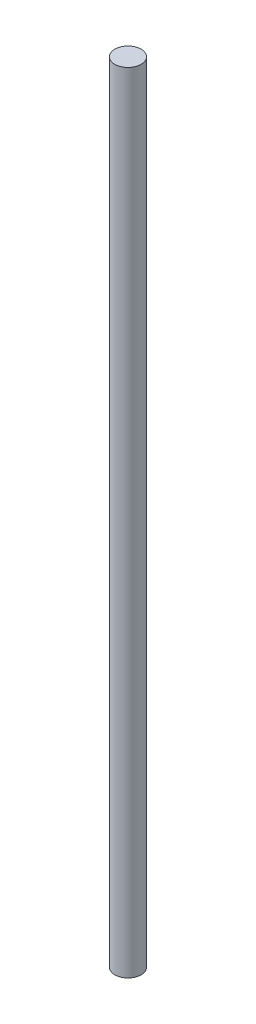
ISO-10303-21;
HEADER;
FILE_DESCRIPTION(('STEP AP214'),'2;1');
FILE_NAME('part.step','',(''),(''),'','','');
FILE_SCHEMA(('AUTOMOTIVE_DESIGN { 1 0 10303 214 1 1 1 1 }'));
ENDSEC;
DATA;
#1=APPLICATION_CONTEXT('core data for automotive mechanical design processes');
#2=APPLICATION_PROTOCOL_DEFINITION('international standard','automotive_design',2000,#1);
#3=PRODUCT_CONTEXT('',#1,'mechanical');
#4=PRODUCT('Part','Part','',(#3));
#5=PRODUCT_RELATED_PRODUCT_CATEGORY('part','',(#4));
#6=PRODUCT_DEFINITION_FORMATION('','',#4);
#7=PRODUCT_DEFINITION_CONTEXT('part definition',#1,'design');
#8=PRODUCT_DEFINITION('design','',#6,#7);
#9=PRODUCT_DEFINITION_SHAPE('','',#8);
#10=(LENGTH_UNIT() NAMED_UNIT(*) SI_UNIT(.MILLI.,.METRE.));
#11=(NAMED_UNIT(*) PLANE_ANGLE_UNIT() SI_UNIT($,.RADIAN.));
#12=(NAMED_UNIT(*) SI_UNIT($,.STERADIAN.) SOLID_ANGLE_UNIT());
#13=UNCERTAINTY_MEASURE_WITH_UNIT(LENGTH_MEASURE(1.E-05),#10,'distance_accuracy_value','');
#14=(GEOMETRIC_REPRESENTATION_CONTEXT(3) GLOBAL_UNCERTAINTY_ASSIGNED_CONTEXT((#13)) GLOBAL_UNIT_ASSIGNED_CONTEXT((#10,
#11,#12)) REPRESENTATION_CONTEXT('',''));
#15=CARTESIAN_POINT('',(0.,0.,0.));
#16=DIRECTION('',(0.,0.,1.));
#17=DIRECTION('',(1.,0.,0.));
#18=AXIS2_PLACEMENT_3D('',#15,#16,#17);
#19=CARTESIAN_POINT('',(0.,150.,0.));
#20=DIRECTION('',(0.,-1.,0.));
#21=DIRECTION('',(0.,0.,-1.));
#22=AXIS2_PLACEMENT_3D('',#19,#20,#21);
#23=CYLINDRICAL_SURFACE('',#22,2.5);
#24=CARTESIAN_POINT('',(0.,150.,0.));
#25=DIRECTION('',(0.,1.,0.));
#26=DIRECTION('',(0.,0.,1.));
#27=AXIS2_PLACEMENT_3D('',#24,#25,#26);
#28=CIRCLE('',#27,2.5);
#29=CARTESIAN_POINT('',(0.,150.,2.5));
#30=VERTEX_POINT('',#29);
#31=EDGE_CURVE('E10',#30,#30,#28,.T.);
#32=ORIENTED_EDGE('',*,*,#31,.F.);
#33=EDGE_LOOP('',(#32));
#34=FACE_BOUND('',#33,.T.);
#35=CARTESIAN_POINT('',(0.,0.,0.));
#36=DIRECTION('',(0.,1.,0.));
#37=DIRECTION('',(0.,0.,1.));
#38=AXIS2_PLACEMENT_3D('',#35,#36,#37);
#39=CIRCLE('',#38,2.5);
#40=CARTESIAN_POINT('',(0.,0.,2.5));
#41=VERTEX_POINT('',#40);
#42=EDGE_CURVE('E34',#41,#41,#39,.T.);
#43=ORIENTED_EDGE('',*,*,#42,.T.);
#44=EDGE_LOOP('',(#43));
#45=FACE_BOUND('',#44,.T.);
#46=ADVANCED_FACE('F31',(#34,#45),#23,.T.);
#47=CARTESIAN_POINT('',(0.,150.,0.));
#48=DIRECTION('',(0.,1.,0.));
#49=DIRECTION('',(0.,0.,1.));
#50=AXIS2_PLACEMENT_3D('',#47,#48,#49);
#51=PLANE('',#50);
#52=ORIENTED_EDGE('',*,*,#31,.T.);
#53=EDGE_LOOP('',(#52));
#54=FACE_BOUND('',#53,.T.);
#55=ADVANCED_FACE('F46',(#54),#51,.T.);
#56=CARTESIAN_POINT('',(0.,0.,0.));
#57=DIRECTION('',(0.,1.,0.));
#58=DIRECTION('',(0.,0.,1.));
#59=AXIS2_PLACEMENT_3D('',#56,#57,#58);
#60=PLANE('',#59);
#61=ORIENTED_EDGE('',*,*,#42,.F.);
#62=EDGE_LOOP('',(#61));
#63=FACE_BOUND('',#62,.T.);
#64=ADVANCED_FACE('F44',(#63),#60,.F.);
#65=CLOSED_SHELL('',(#46,#55,#64));
#66=MANIFOLD_SOLID_BREP('B2',#65);
#67=ADVANCED_BREP_SHAPE_REPRESENTATION('',(#18,#66),#14);
#68=SHAPE_DEFINITION_REPRESENTATION(#9,#67);
ENDSEC;
END-ISO-10303-21;
